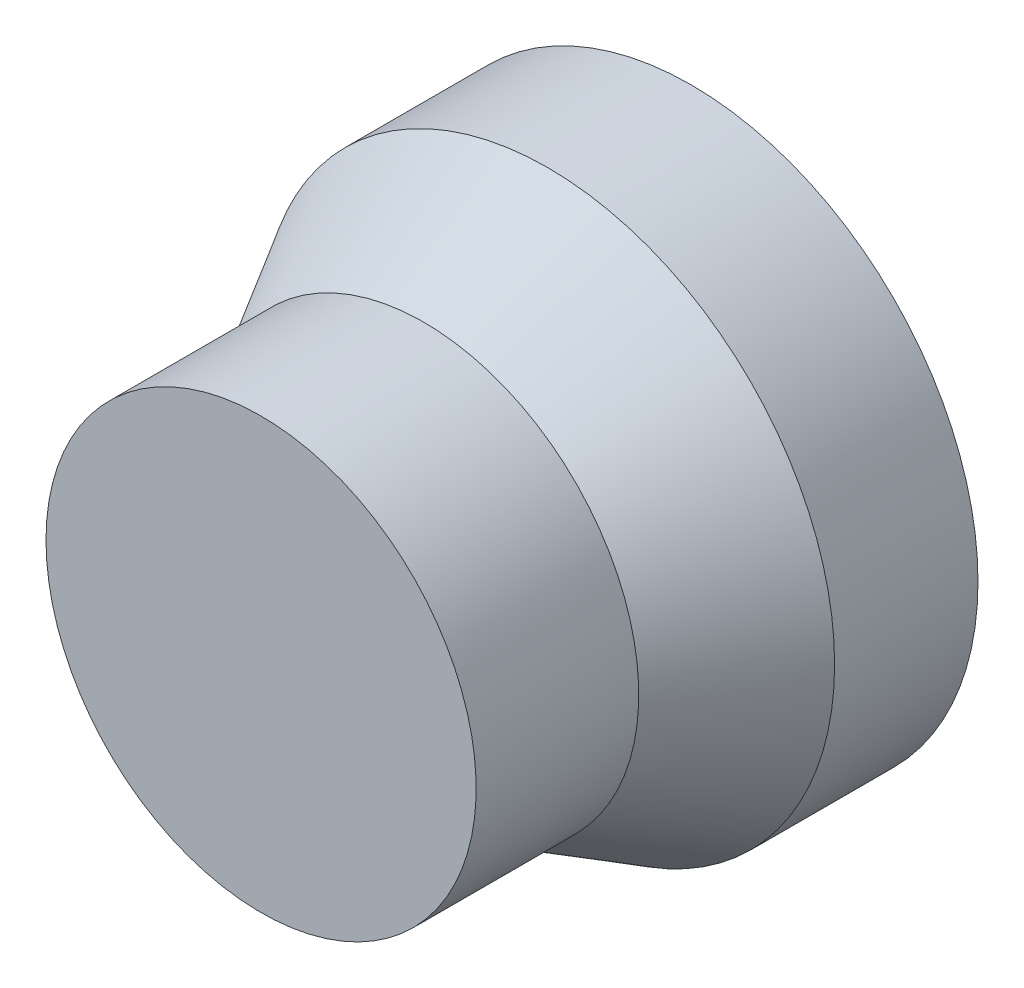
ISO-10303-21;
HEADER;
FILE_DESCRIPTION(('STEP AP214'),'2;1');
FILE_NAME('part.step','',(''),(''),'','','');
FILE_SCHEMA(('AUTOMOTIVE_DESIGN { 1 0 10303 214 1 1 1 1 }'));
ENDSEC;
DATA;
#1=APPLICATION_CONTEXT('core data for automotive mechanical design processes');
#2=APPLICATION_PROTOCOL_DEFINITION('international standard','automotive_design',2000,#1);
#3=PRODUCT_CONTEXT('',#1,'mechanical');
#4=PRODUCT('Part','Part','',(#3));
#5=PRODUCT_RELATED_PRODUCT_CATEGORY('part','',(#4));
#6=PRODUCT_DEFINITION_FORMATION('','',#4);
#7=PRODUCT_DEFINITION_CONTEXT('part definition',#1,'design');
#8=PRODUCT_DEFINITION('design','',#6,#7);
#9=PRODUCT_DEFINITION_SHAPE('','',#8);
#10=(LENGTH_UNIT() NAMED_UNIT(*) SI_UNIT(.MILLI.,.METRE.));
#11=(NAMED_UNIT(*) PLANE_ANGLE_UNIT() SI_UNIT($,.RADIAN.));
#12=(NAMED_UNIT(*) SI_UNIT($,.STERADIAN.) SOLID_ANGLE_UNIT());
#13=UNCERTAINTY_MEASURE_WITH_UNIT(LENGTH_MEASURE(1.E-05),#10,'distance_accuracy_value','');
#14=(GEOMETRIC_REPRESENTATION_CONTEXT(3) GLOBAL_UNCERTAINTY_ASSIGNED_CONTEXT((#13)) GLOBAL_UNIT_ASSIGNED_CONTEXT((#10,
#11,#12)) REPRESENTATION_CONTEXT('',''));
#15=CARTESIAN_POINT('',(0.,0.,0.));
#16=DIRECTION('',(0.,0.,1.));
#17=DIRECTION('',(1.,0.,0.));
#18=AXIS2_PLACEMENT_3D('',#15,#16,#17);
#19=CARTESIAN_POINT('',(0.,0.,150.));
#20=DIRECTION('',(0.,0.,-1.));
#21=DIRECTION('',(-1.,0.,0.));
#22=AXIS2_PLACEMENT_3D('',#19,#20,#21);
#23=PLANE('',#22);
#24=CARTESIAN_POINT('',(0.,0.,150.));
#25=DIRECTION('',(0.,0.,-1.));
#26=DIRECTION('',(-1.,0.,0.));
#27=AXIS2_PLACEMENT_3D('',#24,#25,#26);
#28=CIRCLE('',#27,75.);
#29=CARTESIAN_POINT('',(-75.,0.,150.));
#30=VERTEX_POINT('',#29);
#31=EDGE_CURVE('E10',#30,#30,#28,.T.);
#32=ORIENTED_EDGE('',*,*,#31,.F.);
#33=EDGE_LOOP('',(#32));
#34=FACE_BOUND('',#33,.T.);
#35=ADVANCED_FACE('F34',(#34),#23,.F.);
#36=CARTESIAN_POINT('',(0.,0.,-165.573770491803));
#37=DIRECTION('',(0.,0.,-1.));
#38=DIRECTION('',(-1.,0.,0.));
#39=AXIS2_PLACEMENT_3D('',#36,#37,#38);
#40=CYLINDRICAL_SURFACE('',#39,75.);
#41=CARTESIAN_POINT('',(0.,0.,93.3012701892219));
#42=DIRECTION('',(0.,0.,-1.));
#43=DIRECTION('',(-1.,0.,0.));
#44=AXIS2_PLACEMENT_3D('',#41,#42,#43);
#45=CIRCLE('',#44,75.);
#46=CARTESIAN_POINT('',(-75.,0.,93.3012701892219));
#47=VERTEX_POINT('',#46);
#48=EDGE_CURVE('E40',#47,#47,#45,.T.);
#49=ORIENTED_EDGE('',*,*,#48,.F.);
#50=EDGE_LOOP('',(#49));
#51=FACE_BOUND('',#50,.T.);
#52=ORIENTED_EDGE('',*,*,#31,.T.);
#53=EDGE_LOOP('',(#52));
#54=FACE_BOUND('',#53,.T.);
#55=ADVANCED_FACE('F64',(#51,#54),#40,.T.);
#56=CARTESIAN_POINT('',(0.,0.,93.3012701892219));
#57=DIRECTION('',(0.,0.,-1.));
#58=DIRECTION('',(-1.,0.,0.));
#59=AXIS2_PLACEMENT_3D('',#56,#57,#58);
#60=CONICAL_SURFACE('',#59,75.,0.523598775598299);
#61=CARTESIAN_POINT('',(0.,0.,50.));
#62=DIRECTION('',(0.,0.,-1.));
#63=DIRECTION('',(-1.,0.,0.));
#64=AXIS2_PLACEMENT_3D('',#61,#62,#63);
#65=CIRCLE('',#64,100.);
#66=CARTESIAN_POINT('',(-100.,0.,50.));
#67=VERTEX_POINT('',#66);
#68=EDGE_CURVE('E44',#67,#67,#65,.T.);
#69=ORIENTED_EDGE('',*,*,#68,.F.);
#70=EDGE_LOOP('',(#69));
#71=FACE_BOUND('',#70,.T.);
#72=ORIENTED_EDGE('',*,*,#48,.T.);
#73=EDGE_LOOP('',(#72));
#74=FACE_BOUND('',#73,.T.);
#75=ADVANCED_FACE('F59',(#71,#74),#60,.T.);
#76=CARTESIAN_POINT('',(0.,0.,-165.573770491803));
#77=DIRECTION('',(0.,0.,-1.));
#78=DIRECTION('',(-1.,0.,0.));
#79=AXIS2_PLACEMENT_3D('',#76,#77,#78);
#80=CYLINDRICAL_SURFACE('',#79,100.);
#81=CARTESIAN_POINT('',(0.,0.,0.));
#82=DIRECTION('',(0.,0.,-1.));
#83=DIRECTION('',(-1.,0.,0.));
#84=AXIS2_PLACEMENT_3D('',#81,#82,#83);
#85=CIRCLE('',#84,100.);
#86=CARTESIAN_POINT('',(-100.,0.,0.));
#87=VERTEX_POINT('',#86);
#88=EDGE_CURVE('E48',#87,#87,#85,.T.);
#89=ORIENTED_EDGE('',*,*,#88,.F.);
#90=EDGE_LOOP('',(#89));
#91=FACE_BOUND('',#90,.T.);
#92=ORIENTED_EDGE('',*,*,#68,.T.);
#93=EDGE_LOOP('',(#92));
#94=FACE_BOUND('',#93,.T.);
#95=ADVANCED_FACE('F56',(#91,#94),#80,.T.);
#96=CARTESIAN_POINT('',(100.,0.,0.));
#97=DIRECTION('',(0.,0.,1.));
#98=DIRECTION('',(1.,0.,0.));
#99=AXIS2_PLACEMENT_3D('',#96,#97,#98);
#100=PLANE('',#99);
#101=ORIENTED_EDGE('',*,*,#88,.T.);
#102=EDGE_LOOP('',(#101));
#103=FACE_BOUND('',#102,.T.);
#104=ADVANCED_FACE('F54',(#103),#100,.F.);
#105=CLOSED_SHELL('',(#35,#55,#75,#95,#104));
#106=MANIFOLD_SOLID_BREP('B2',#105);
#107=ADVANCED_BREP_SHAPE_REPRESENTATION('',(#18,#106),#14);
#108=SHAPE_DEFINITION_REPRESENTATION(#9,#107);
ENDSEC;
END-ISO-10303-21;
